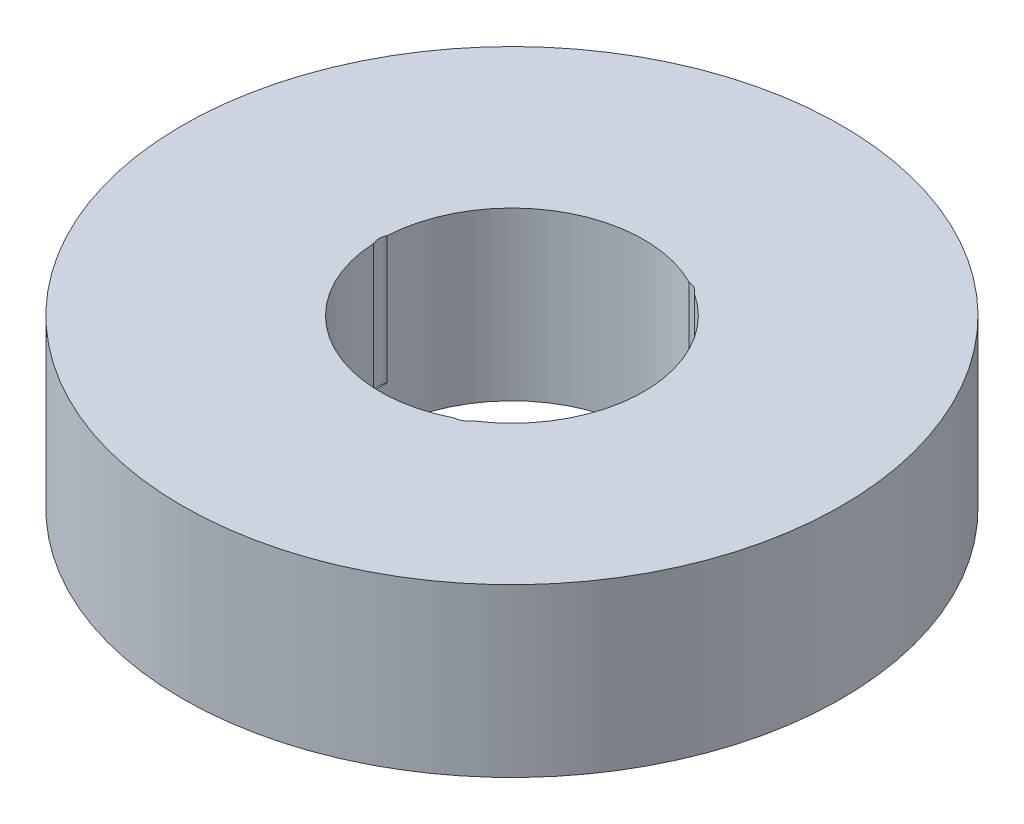
ISO-10303-21;
HEADER;
FILE_DESCRIPTION(('STEP AP214'),'2;1');
FILE_NAME('part.step','',(''),(''),'','','');
FILE_SCHEMA(('AUTOMOTIVE_DESIGN { 1 0 10303 214 1 1 1 1 }'));
ENDSEC;
DATA;
#1=APPLICATION_CONTEXT('core data for automotive mechanical design processes');
#2=APPLICATION_PROTOCOL_DEFINITION('international standard','automotive_design',2000,#1);
#3=PRODUCT_CONTEXT('',#1,'mechanical');
#4=PRODUCT('Part','Part','',(#3));
#5=PRODUCT_RELATED_PRODUCT_CATEGORY('part','',(#4));
#6=PRODUCT_DEFINITION_FORMATION('','',#4);
#7=PRODUCT_DEFINITION_CONTEXT('part definition',#1,'design');
#8=PRODUCT_DEFINITION('design','',#6,#7);
#9=PRODUCT_DEFINITION_SHAPE('','',#8);
#10=(LENGTH_UNIT() NAMED_UNIT(*) SI_UNIT(.MILLI.,.METRE.));
#11=(NAMED_UNIT(*) PLANE_ANGLE_UNIT() SI_UNIT($,.RADIAN.));
#12=(NAMED_UNIT(*) SI_UNIT($,.STERADIAN.) SOLID_ANGLE_UNIT());
#13=UNCERTAINTY_MEASURE_WITH_UNIT(LENGTH_MEASURE(1.E-05),#10,'distance_accuracy_value','');
#14=(GEOMETRIC_REPRESENTATION_CONTEXT(3) GLOBAL_UNCERTAINTY_ASSIGNED_CONTEXT((#13)) GLOBAL_UNIT_ASSIGNED_CONTEXT((#10,
#11,#12)) REPRESENTATION_CONTEXT('',''));
#15=CARTESIAN_POINT('',(0.,0.,0.));
#16=DIRECTION('',(0.,0.,1.));
#17=DIRECTION('',(1.,0.,0.));
#18=AXIS2_PLACEMENT_3D('',#15,#16,#17);
#19=CARTESIAN_POINT('',(0.,19.,0.));
#20=DIRECTION('',(0.,-1.,0.));
#21=DIRECTION('',(0.,0.,-1.));
#22=AXIS2_PLACEMENT_3D('',#19,#20,#21);
#23=CYLINDRICAL_SURFACE('',#22,37.5);
#24=CARTESIAN_POINT('',(0.,19.,0.));
#25=DIRECTION('',(0.,1.,0.));
#26=DIRECTION('',(0.,0.,1.));
#27=AXIS2_PLACEMENT_3D('',#24,#25,#26);
#28=CIRCLE('',#27,37.5);
#29=CARTESIAN_POINT('',(0.,19.,37.5));
#30=VERTEX_POINT('',#29);
#31=EDGE_CURVE('E130',#30,#30,#28,.T.);
#32=ORIENTED_EDGE('',*,*,#31,.F.);
#33=EDGE_LOOP('',(#32));
#34=FACE_BOUND('',#33,.T.);
#35=CARTESIAN_POINT('',(0.,0.,0.));
#36=DIRECTION('',(0.,1.,0.));
#37=DIRECTION('',(0.,0.,1.));
#38=AXIS2_PLACEMENT_3D('',#35,#36,#37);
#39=CIRCLE('',#38,37.5);
#40=CARTESIAN_POINT('',(0.,0.,37.5));
#41=VERTEX_POINT('',#40);
#42=EDGE_CURVE('E117',#41,#41,#39,.T.);
#43=ORIENTED_EDGE('',*,*,#42,.T.);
#44=EDGE_LOOP('',(#43));
#45=FACE_BOUND('',#44,.T.);
#46=ADVANCED_FACE('F39',(#34,#45),#23,.T.);
#47=CARTESIAN_POINT('',(0.,19.,0.));
#48=DIRECTION('',(0.,1.,0.));
#49=DIRECTION('',(0.,0.,1.));
#50=AXIS2_PLACEMENT_3D('',#47,#48,#49);
#51=PLANE('',#50);
#52=CARTESIAN_POINT('',(6.69019850277874,19.,11.5877637195339));
#53=DIRECTION('',(0.,1.,0.));
#54=DIRECTION('',(0.866025403784436,0.,-0.500000000000004));
#55=AXIS2_PLACEMENT_3D('',#52,#53,#54);
#56=CIRCLE('',#55,1.78146606394542);
#57=CARTESIAN_POINT('',(6.80961171370782,19.,13.3652230923593));
#58=VERTEX_POINT('',#57);
#59=CARTESIAN_POINT('',(8.16981686837574,19.,12.5799082801586));
#60=VERTEX_POINT('',#59);
#61=EDGE_CURVE('E148',#58,#60,#56,.T.);
#62=ORIENTED_EDGE('',*,*,#61,.F.);
#63=CARTESIAN_POINT('',(0.,19.,0.));
#64=DIRECTION('',(0.,1.,0.));
#65=DIRECTION('',(0.,0.,1.));
#66=AXIS2_PLACEMENT_3D('',#63,#64,#65);
#67=CIRCLE('',#66,15.);
#68=CARTESIAN_POINT('',(-14.9794285820834,19.,0.785314812200639));
#69=VERTEX_POINT('',#68);
#70=EDGE_CURVE('E113',#69,#58,#67,.T.);
#71=ORIENTED_EDGE('',*,*,#70,.F.);
#72=CARTESIAN_POINT('',(-13.3803970055574,19.,0.));
#73=DIRECTION('',(0.,1.,0.));
#74=DIRECTION('',(0.,0.,1.));
#75=AXIS2_PLACEMENT_3D('',#72,#73,#74);
#76=CIRCLE('',#75,1.78146606394542);
#77=CARTESIAN_POINT('',(-14.9794285820834,19.,-0.785314812200639));
#78=VERTEX_POINT('',#77);
#79=EDGE_CURVE('E125',#78,#69,#76,.T.);
#80=ORIENTED_EDGE('',*,*,#79,.F.);
#81=CARTESIAN_POINT('',(6.80961171370764,19.,-13.3652230923594));
#82=VERTEX_POINT('',#81);
#83=EDGE_CURVE('E107',#82,#78,#67,.T.);
#84=ORIENTED_EDGE('',*,*,#83,.F.);
#85=CARTESIAN_POINT('',(6.69019850277858,19.,-11.587763719534));
#86=DIRECTION('',(0.,1.,0.));
#87=DIRECTION('',(-0.866025403784443,0.,-0.499999999999992));
#88=AXIS2_PLACEMENT_3D('',#85,#86,#87);
#89=CIRCLE('',#88,1.78146606394542);
#90=CARTESIAN_POINT('',(8.16981686837556,19.,-12.5799082801587));
#91=VERTEX_POINT('',#90);
#92=EDGE_CURVE('E95',#91,#82,#89,.T.);
#93=ORIENTED_EDGE('',*,*,#92,.F.);
#94=EDGE_CURVE('E106',#60,#91,#67,.T.);
#95=ORIENTED_EDGE('',*,*,#94,.F.);
#96=EDGE_LOOP('',(#62,#71,#80,#84,#93,#95));
#97=FACE_BOUND('',#96,.T.);
#98=ORIENTED_EDGE('',*,*,#31,.T.);
#99=EDGE_LOOP('',(#98));
#100=FACE_BOUND('',#99,.T.);
#101=ADVANCED_FACE('F102',(#97,#100),#51,.T.);
#102=CARTESIAN_POINT('',(0.,0.,0.));
#103=DIRECTION('',(0.,1.,0.));
#104=DIRECTION('',(0.,0.,1.));
#105=AXIS2_PLACEMENT_3D('',#102,#103,#104);
#106=PLANE('',#105);
#107=CARTESIAN_POINT('',(0.,0.,0.));
#108=DIRECTION('',(0.,1.,0.));
#109=DIRECTION('',(0.,0.,1.));
#110=AXIS2_PLACEMENT_3D('',#107,#108,#109);
#111=CIRCLE('',#110,15.);
#112=CARTESIAN_POINT('',(0.,0.,15.));
#113=VERTEX_POINT('',#112);
#114=EDGE_CURVE('E118',#113,#113,#111,.T.);
#115=ORIENTED_EDGE('',*,*,#114,.T.);
#116=EDGE_LOOP('',(#115));
#117=FACE_BOUND('',#116,.T.);
#118=ORIENTED_EDGE('',*,*,#42,.F.);
#119=EDGE_LOOP('',(#118));
#120=FACE_BOUND('',#119,.T.);
#121=ADVANCED_FACE('F161',(#117,#120),#106,.F.);
#122=CARTESIAN_POINT('',(0.,19.,0.));
#123=DIRECTION('',(0.,-1.,0.));
#124=DIRECTION('',(0.,0.,-1.));
#125=AXIS2_PLACEMENT_3D('',#122,#123,#124);
#126=CYLINDRICAL_SURFACE('',#125,15.);
#127=DIRECTION('',(0.,1.,0.));
#128=VECTOR('',#127,1.);
#129=CARTESIAN_POINT('',(6.80961171370777,11.744967903167,13.3652230923593));
#130=LINE('',#129,#128);
#131=CARTESIAN_POINT('',(6.80961171370782,4.48993580633396,13.3652230923593));
#132=VERTEX_POINT('',#131);
#133=EDGE_CURVE('E11',#132,#58,#130,.T.);
#134=ORIENTED_EDGE('',*,*,#133,.F.);
#135=CARTESIAN_POINT('',(0.,4.48993580633396,0.));
#136=DIRECTION('',(0.,1.,0.));
#137=DIRECTION('',(0.,0.,1.));
#138=AXIS2_PLACEMENT_3D('',#135,#136,#137);
#139=CIRCLE('',#138,15.);
#140=CARTESIAN_POINT('',(8.16981686837574,4.48993580633396,12.5799082801586));
#141=VERTEX_POINT('',#140);
#142=EDGE_CURVE('E100',#132,#141,#139,.T.);
#143=ORIENTED_EDGE('',*,*,#142,.T.);
#144=DIRECTION('',(0.,1.,0.));
#145=VECTOR('',#144,1.);
#146=CARTESIAN_POINT('',(8.16981686837577,11.744967903167,12.5799082801586));
#147=LINE('',#146,#145);
#148=EDGE_CURVE('E46',#60,#141,#147,.F.);
#149=ORIENTED_EDGE('',*,*,#148,.F.);
#150=ORIENTED_EDGE('',*,*,#94,.T.);
#151=DIRECTION('',(0.,1.,0.));
#152=VECTOR('',#151,1.);
#153=CARTESIAN_POINT('',(8.16981686837557,11.744967903167,-12.5799082801587));
#154=LINE('',#153,#152);
#155=CARTESIAN_POINT('',(8.16981686837556,4.48993580633396,-12.5799082801587));
#156=VERTEX_POINT('',#155);
#157=EDGE_CURVE('E90',#156,#91,#154,.T.);
#158=ORIENTED_EDGE('',*,*,#157,.F.);
#159=CARTESIAN_POINT('',(0.,4.48993580633396,0.));
#160=DIRECTION('',(0.,1.,0.));
#161=DIRECTION('',(0.,0.,1.));
#162=AXIS2_PLACEMENT_3D('',#159,#160,#161);
#163=CIRCLE('',#162,15.);
#164=CARTESIAN_POINT('',(6.80961171370764,4.48993580633396,-13.3652230923594));
#165=VERTEX_POINT('',#164);
#166=EDGE_CURVE('E143',#156,#165,#163,.T.);
#167=ORIENTED_EDGE('',*,*,#166,.T.);
#168=DIRECTION('',(0.,1.,0.));
#169=VECTOR('',#168,1.);
#170=CARTESIAN_POINT('',(6.80961171370762,11.744967903167,-13.3652230923594));
#171=LINE('',#170,#169);
#172=EDGE_CURVE('E98',#82,#165,#171,.F.);
#173=ORIENTED_EDGE('',*,*,#172,.F.);
#174=ORIENTED_EDGE('',*,*,#83,.T.);
#175=DIRECTION('',(0.,1.,0.));
#176=VECTOR('',#175,1.);
#177=CARTESIAN_POINT('',(-14.9794285820834,11.744967903167,-0.785314812200654));
#178=LINE('',#177,#176);
#179=CARTESIAN_POINT('',(-14.9794285820834,4.48993580633396,-0.785314812200639));
#180=VERTEX_POINT('',#179);
#181=EDGE_CURVE('E137',#180,#78,#178,.T.);
#182=ORIENTED_EDGE('',*,*,#181,.F.);
#183=CARTESIAN_POINT('',(0.,4.48993580633396,0.));
#184=DIRECTION('',(0.,1.,0.));
#185=DIRECTION('',(0.,0.,1.));
#186=AXIS2_PLACEMENT_3D('',#183,#184,#185);
#187=CIRCLE('',#186,15.);
#188=CARTESIAN_POINT('',(-14.9794285820834,4.48993580633396,0.785314812200639));
#189=VERTEX_POINT('',#188);
#190=EDGE_CURVE('E128',#180,#189,#187,.T.);
#191=ORIENTED_EDGE('',*,*,#190,.T.);
#192=DIRECTION('',(0.,1.,0.));
#193=VECTOR('',#192,1.);
#194=CARTESIAN_POINT('',(-14.9794285820834,11.744967903167,0.785314812200654));
#195=LINE('',#194,#193);
#196=EDGE_CURVE('E134',#69,#189,#195,.F.);
#197=ORIENTED_EDGE('',*,*,#196,.F.);
#198=ORIENTED_EDGE('',*,*,#70,.T.);
#199=EDGE_LOOP('',(#134,#143,#149,#150,#158,#167,#173,#174,#182,#191,#197,#198));
#200=FACE_BOUND('',#199,.T.);
#201=ORIENTED_EDGE('',*,*,#114,.F.);
#202=EDGE_LOOP('',(#201));
#203=FACE_BOUND('',#202,.T.);
#204=ADVANCED_FACE('F115',(#200,#203),#126,.F.);
#205=CARTESIAN_POINT('',(-13.3803970055574,4.48993580633396,0.));
#206=DIRECTION('',(0.,1.,0.));
#207=DIRECTION('',(0.,0.,1.));
#208=AXIS2_PLACEMENT_3D('',#205,#206,#207);
#209=CYLINDRICAL_SURFACE('',#208,1.78146606394542);
#210=ORIENTED_EDGE('',*,*,#181,.T.);
#211=ORIENTED_EDGE('',*,*,#79,.T.);
#212=ORIENTED_EDGE('',*,*,#196,.T.);
#213=CARTESIAN_POINT('',(-13.3803970055574,4.48993580633396,0.));
#214=DIRECTION('',(0.,1.,0.));
#215=DIRECTION('',(0.,0.,1.));
#216=AXIS2_PLACEMENT_3D('',#213,#214,#215);
#217=CIRCLE('',#216,1.78146606394542);
#218=EDGE_CURVE('E127',#180,#189,#217,.T.);
#219=ORIENTED_EDGE('',*,*,#218,.F.);
#220=EDGE_LOOP('',(#210,#211,#212,#219));
#221=FACE_BOUND('',#220,.T.);
#222=ADVANCED_FACE('F175',(#221),#209,.F.);
#223=CARTESIAN_POINT('',(-13.3803970055574,4.48993580633396,0.));
#224=DIRECTION('',(0.,1.,0.));
#225=DIRECTION('',(0.,0.,1.));
#226=AXIS2_PLACEMENT_3D('',#223,#224,#225);
#227=PLANE('',#226);
#228=ORIENTED_EDGE('',*,*,#218,.T.);
#229=ORIENTED_EDGE('',*,*,#190,.F.);
#230=EDGE_LOOP('',(#228,#229));
#231=FACE_BOUND('',#230,.T.);
#232=ADVANCED_FACE('F176',(#231),#227,.T.);
#233=CARTESIAN_POINT('',(6.69019850277858,4.48993580633396,-11.587763719534));
#234=DIRECTION('',(0.,1.,0.));
#235=DIRECTION('',(0.,0.,1.));
#236=AXIS2_PLACEMENT_3D('',#233,#234,#235);
#237=CYLINDRICAL_SURFACE('',#236,1.78146606394542);
#238=ORIENTED_EDGE('',*,*,#157,.T.);
#239=ORIENTED_EDGE('',*,*,#92,.T.);
#240=ORIENTED_EDGE('',*,*,#172,.T.);
#241=CARTESIAN_POINT('',(6.69019850277858,4.48993580633396,-11.587763719534));
#242=DIRECTION('',(0.,1.,0.));
#243=DIRECTION('',(-0.866025403784443,0.,-0.499999999999992));
#244=AXIS2_PLACEMENT_3D('',#241,#242,#243);
#245=CIRCLE('',#244,1.78146606394542);
#246=EDGE_CURVE('E56',#156,#165,#245,.T.);
#247=ORIENTED_EDGE('',*,*,#246,.F.);
#248=EDGE_LOOP('',(#238,#239,#240,#247));
#249=FACE_BOUND('',#248,.T.);
#250=ADVANCED_FACE('F93',(#249),#237,.F.);
#251=CARTESIAN_POINT('',(6.69019850277858,4.48993580633396,-11.587763719534));
#252=DIRECTION('',(0.,1.,0.));
#253=DIRECTION('',(-0.866025403784443,0.,-0.499999999999992));
#254=AXIS2_PLACEMENT_3D('',#251,#252,#253);
#255=PLANE('',#254);
#256=ORIENTED_EDGE('',*,*,#246,.T.);
#257=ORIENTED_EDGE('',*,*,#166,.F.);
#258=EDGE_LOOP('',(#256,#257));
#259=FACE_BOUND('',#258,.T.);
#260=ADVANCED_FACE('F153',(#259),#255,.T.);
#261=CARTESIAN_POINT('',(6.69019850277874,4.48993580633396,11.5877637195339));
#262=DIRECTION('',(0.,1.,0.));
#263=DIRECTION('',(0.,0.,1.));
#264=AXIS2_PLACEMENT_3D('',#261,#262,#263);
#265=CYLINDRICAL_SURFACE('',#264,1.78146606394542);
#266=ORIENTED_EDGE('',*,*,#133,.T.);
#267=ORIENTED_EDGE('',*,*,#61,.T.);
#268=ORIENTED_EDGE('',*,*,#148,.T.);
#269=CARTESIAN_POINT('',(6.69019850277874,4.48993580633396,11.5877637195339));
#270=DIRECTION('',(0.,1.,0.));
#271=DIRECTION('',(0.866025403784436,0.,-0.500000000000004));
#272=AXIS2_PLACEMENT_3D('',#269,#270,#271);
#273=CIRCLE('',#272,1.78146606394542);
#274=EDGE_CURVE('E55',#132,#141,#273,.T.);
#275=ORIENTED_EDGE('',*,*,#274,.F.);
#276=EDGE_LOOP('',(#266,#267,#268,#275));
#277=FACE_BOUND('',#276,.T.);
#278=ADVANCED_FACE('F144',(#277),#265,.F.);
#279=CARTESIAN_POINT('',(6.69019850277874,4.48993580633396,11.5877637195339));
#280=DIRECTION('',(0.,1.,0.));
#281=DIRECTION('',(0.866025403784436,0.,-0.500000000000004));
#282=AXIS2_PLACEMENT_3D('',#279,#280,#281);
#283=PLANE('',#282);
#284=ORIENTED_EDGE('',*,*,#274,.T.);
#285=ORIENTED_EDGE('',*,*,#142,.F.);
#286=EDGE_LOOP('',(#284,#285));
#287=FACE_BOUND('',#286,.T.);
#288=ADVANCED_FACE('F150',(#287),#283,.T.);
#289=CLOSED_SHELL('',(#46,#101,#121,#204,#222,#232,#250,#260,#278,#288));
#290=MANIFOLD_SOLID_BREP('B2',#289);
#291=ADVANCED_BREP_SHAPE_REPRESENTATION('',(#18,#290),#14);
#292=SHAPE_DEFINITION_REPRESENTATION(#9,#291);
ENDSEC;
END-ISO-10303-21;
